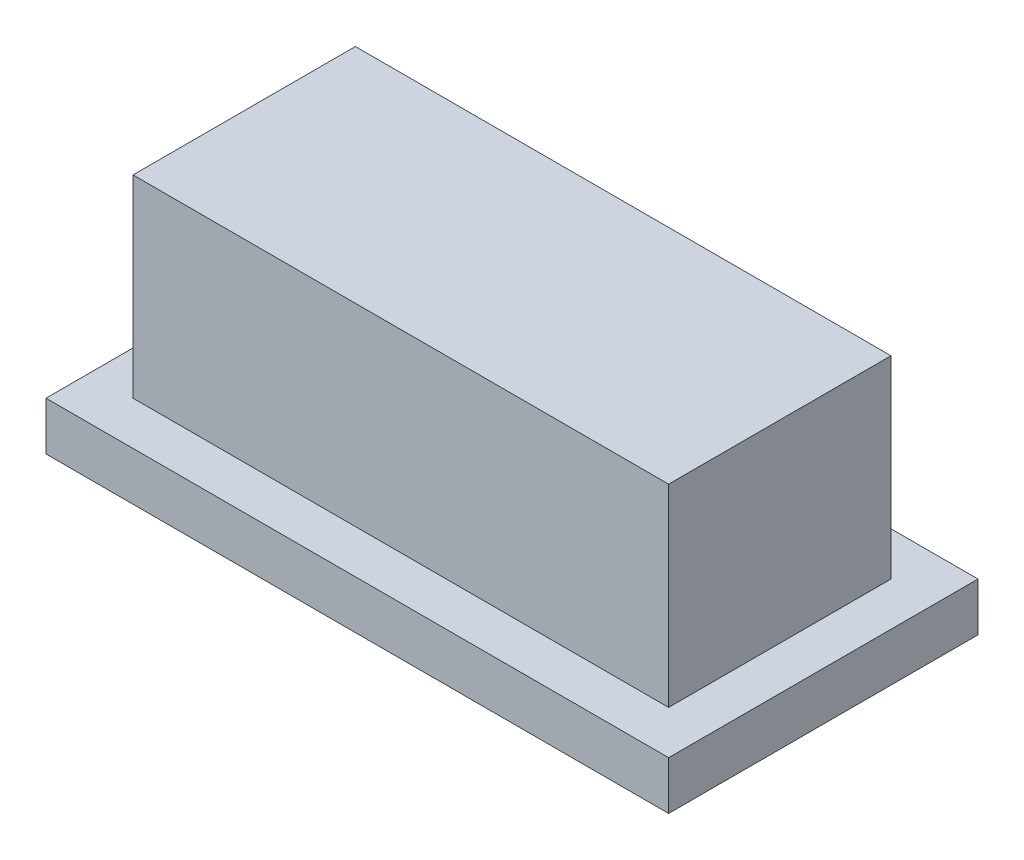
ISO-10303-21;
HEADER;
FILE_DESCRIPTION(('STEP AP214'),'2;1');
FILE_NAME('part.step','',(''),(''),'','','');
FILE_SCHEMA(('AUTOMOTIVE_DESIGN { 1 0 10303 214 1 1 1 1 }'));
ENDSEC;
DATA;
#1=APPLICATION_CONTEXT('core data for automotive mechanical design processes');
#2=APPLICATION_PROTOCOL_DEFINITION('international standard','automotive_design',2000,#1);
#3=PRODUCT_CONTEXT('',#1,'mechanical');
#4=PRODUCT('Part','Part','',(#3));
#5=PRODUCT_RELATED_PRODUCT_CATEGORY('part','',(#4));
#6=PRODUCT_DEFINITION_FORMATION('','',#4);
#7=PRODUCT_DEFINITION_CONTEXT('part definition',#1,'design');
#8=PRODUCT_DEFINITION('design','',#6,#7);
#9=PRODUCT_DEFINITION_SHAPE('','',#8);
#10=(LENGTH_UNIT() NAMED_UNIT(*) SI_UNIT(.MILLI.,.METRE.));
#11=(NAMED_UNIT(*) PLANE_ANGLE_UNIT() SI_UNIT($,.RADIAN.));
#12=(NAMED_UNIT(*) SI_UNIT($,.STERADIAN.) SOLID_ANGLE_UNIT());
#13=UNCERTAINTY_MEASURE_WITH_UNIT(LENGTH_MEASURE(1.E-05),#10,'distance_accuracy_value','');
#14=(GEOMETRIC_REPRESENTATION_CONTEXT(3) GLOBAL_UNCERTAINTY_ASSIGNED_CONTEXT((#13)) GLOBAL_UNIT_ASSIGNED_CONTEXT((#10,
#11,#12)) REPRESENTATION_CONTEXT('',''));
#15=CARTESIAN_POINT('',(0.,0.,0.));
#16=DIRECTION('',(0.,0.,1.));
#17=DIRECTION('',(1.,0.,0.));
#18=AXIS2_PLACEMENT_3D('',#15,#16,#17);
#19=CARTESIAN_POINT('',(0.,1.,0.));
#20=DIRECTION('',(0.,1.,0.));
#21=DIRECTION('',(0.,0.,1.));
#22=AXIS2_PLACEMENT_3D('',#19,#20,#21);
#23=PLANE('',#22);
#24=DIRECTION('',(0.,0.,-1.));
#25=VECTOR('',#24,1.);
#26=CARTESIAN_POINT('',(0.,1.,0.));
#27=LINE('',#26,#25);
#28=CARTESIAN_POINT('',(0.,1.,0.));
#29=VERTEX_POINT('',#28);
#30=CARTESIAN_POINT('',(0.,1.,-6.4));
#31=VERTEX_POINT('',#30);
#32=EDGE_CURVE('E191',#29,#31,#27,.T.);
#33=ORIENTED_EDGE('',*,*,#32,.F.);
#34=DIRECTION('',(1.,0.,0.));
#35=VECTOR('',#34,1.);
#36=CARTESIAN_POINT('',(0.,1.,0.));
#37=LINE('',#36,#35);
#38=CARTESIAN_POINT('',(12.88,1.,0.));
#39=VERTEX_POINT('',#38);
#40=EDGE_CURVE('E194',#29,#39,#37,.T.);
#41=ORIENTED_EDGE('',*,*,#40,.T.);
#42=DIRECTION('',(0.,0.,-1.));
#43=VECTOR('',#42,1.);
#44=CARTESIAN_POINT('',(12.88,1.,0.));
#45=LINE('',#44,#43);
#46=CARTESIAN_POINT('',(12.88,1.,-6.4));
#47=VERTEX_POINT('',#46);
#48=EDGE_CURVE('E197',#39,#47,#45,.T.);
#49=ORIENTED_EDGE('',*,*,#48,.T.);
#50=DIRECTION('',(1.,0.,0.));
#51=VECTOR('',#50,1.);
#52=CARTESIAN_POINT('',(0.,1.,-6.4));
#53=LINE('',#52,#51);
#54=EDGE_CURVE('E199',#31,#47,#53,.T.);
#55=ORIENTED_EDGE('',*,*,#54,.F.);
#56=EDGE_LOOP('',(#33,#41,#49,#55));
#57=FACE_BOUND('',#56,.T.);
#58=DIRECTION('',(0.,0.,1.));
#59=VECTOR('',#58,1.);
#60=CARTESIAN_POINT('',(0.9,1.,-5.5));
#61=LINE('',#60,#59);
#62=CARTESIAN_POINT('',(0.9,1.,-5.5));
#63=VERTEX_POINT('',#62);
#64=CARTESIAN_POINT('',(0.9,1.,-0.9));
#65=VERTEX_POINT('',#64);
#66=EDGE_CURVE('E177',#63,#65,#61,.T.);
#67=ORIENTED_EDGE('',*,*,#66,.F.);
#68=DIRECTION('',(-1.,0.,0.));
#69=VECTOR('',#68,1.);
#70=CARTESIAN_POINT('',(11.98,1.,-5.5));
#71=LINE('',#70,#69);
#72=CARTESIAN_POINT('',(11.98,1.,-5.5));
#73=VERTEX_POINT('',#72);
#74=EDGE_CURVE('E160',#73,#63,#71,.T.);
#75=ORIENTED_EDGE('',*,*,#74,.F.);
#76=DIRECTION('',(0.,0.,-1.));
#77=VECTOR('',#76,1.);
#78=CARTESIAN_POINT('',(11.98,1.,-0.9));
#79=LINE('',#78,#77);
#80=CARTESIAN_POINT('',(11.98,1.,-0.9));
#81=VERTEX_POINT('',#80);
#82=EDGE_CURVE('E168',#81,#73,#79,.T.);
#83=ORIENTED_EDGE('',*,*,#82,.F.);
#84=DIRECTION('',(1.,0.,0.));
#85=VECTOR('',#84,1.);
#86=CARTESIAN_POINT('',(0.9,1.,-0.9));
#87=LINE('',#86,#85);
#88=EDGE_CURVE('E179',#65,#81,#87,.T.);
#89=ORIENTED_EDGE('',*,*,#88,.F.);
#90=EDGE_LOOP('',(#67,#75,#83,#89));
#91=FACE_BOUND('',#90,.T.);
#92=ADVANCED_FACE('F36',(#57,#91),#23,.T.);
#93=CARTESIAN_POINT('',(0.,1.,0.));
#94=DIRECTION('',(-1.,0.,0.));
#95=DIRECTION('',(0.,0.,1.));
#96=AXIS2_PLACEMENT_3D('',#93,#94,#95);
#97=PLANE('',#96);
#98=DIRECTION('',(0.,0.,-1.));
#99=VECTOR('',#98,1.);
#100=CARTESIAN_POINT('',(0.,0.,0.));
#101=LINE('',#100,#99);
#102=CARTESIAN_POINT('',(0.,0.,0.));
#103=VERTEX_POINT('',#102);
#104=CARTESIAN_POINT('',(0.,0.,-6.4));
#105=VERTEX_POINT('',#104);
#106=EDGE_CURVE('E190',#103,#105,#101,.T.);
#107=ORIENTED_EDGE('',*,*,#106,.F.);
#108=DIRECTION('',(0.,-1.,0.));
#109=VECTOR('',#108,1.);
#110=CARTESIAN_POINT('',(0.,1.,0.));
#111=LINE('',#110,#109);
#112=EDGE_CURVE('E11',#29,#103,#111,.T.);
#113=ORIENTED_EDGE('',*,*,#112,.F.);
#114=ORIENTED_EDGE('',*,*,#32,.T.);
#115=DIRECTION('',(0.,-1.,0.));
#116=VECTOR('',#115,1.);
#117=CARTESIAN_POINT('',(0.,1.,-6.4));
#118=LINE('',#117,#116);
#119=EDGE_CURVE('E202',#31,#105,#118,.T.);
#120=ORIENTED_EDGE('',*,*,#119,.T.);
#121=EDGE_LOOP('',(#107,#113,#114,#120));
#122=FACE_BOUND('',#121,.T.);
#123=ADVANCED_FACE('F38',(#122),#97,.T.);
#124=CARTESIAN_POINT('',(0.,1.,0.));
#125=DIRECTION('',(0.,0.,-1.));
#126=DIRECTION('',(-1.,0.,0.));
#127=AXIS2_PLACEMENT_3D('',#124,#125,#126);
#128=PLANE('',#127);
#129=DIRECTION('',(1.,0.,0.));
#130=VECTOR('',#129,1.);
#131=CARTESIAN_POINT('',(0.,0.,0.));
#132=LINE('',#131,#130);
#133=CARTESIAN_POINT('',(12.88,0.,0.));
#134=VERTEX_POINT('',#133);
#135=EDGE_CURVE('E205',#103,#134,#132,.T.);
#136=ORIENTED_EDGE('',*,*,#135,.T.);
#137=DIRECTION('',(0.,-1.,0.));
#138=VECTOR('',#137,1.);
#139=CARTESIAN_POINT('',(12.88,1.,0.));
#140=LINE('',#139,#138);
#141=EDGE_CURVE('E44',#39,#134,#140,.T.);
#142=ORIENTED_EDGE('',*,*,#141,.F.);
#143=ORIENTED_EDGE('',*,*,#40,.F.);
#144=ORIENTED_EDGE('',*,*,#112,.T.);
#145=EDGE_LOOP('',(#136,#142,#143,#144));
#146=FACE_BOUND('',#145,.T.);
#147=ADVANCED_FACE('F234',(#146),#128,.F.);
#148=CARTESIAN_POINT('',(12.88,1.,0.));
#149=DIRECTION('',(-1.,0.,0.));
#150=DIRECTION('',(0.,0.,1.));
#151=AXIS2_PLACEMENT_3D('',#148,#149,#150);
#152=PLANE('',#151);
#153=DIRECTION('',(0.,0.,-1.));
#154=VECTOR('',#153,1.);
#155=CARTESIAN_POINT('',(12.88,0.,0.));
#156=LINE('',#155,#154);
#157=CARTESIAN_POINT('',(12.88,0.,-6.4));
#158=VERTEX_POINT('',#157);
#159=EDGE_CURVE('E207',#134,#158,#156,.T.);
#160=ORIENTED_EDGE('',*,*,#159,.T.);
#161=DIRECTION('',(0.,-1.,0.));
#162=VECTOR('',#161,1.);
#163=CARTESIAN_POINT('',(12.88,1.,-6.4));
#164=LINE('',#163,#162);
#165=EDGE_CURVE('E213',#47,#158,#164,.T.);
#166=ORIENTED_EDGE('',*,*,#165,.F.);
#167=ORIENTED_EDGE('',*,*,#48,.F.);
#168=ORIENTED_EDGE('',*,*,#141,.T.);
#169=EDGE_LOOP('',(#160,#166,#167,#168));
#170=FACE_BOUND('',#169,.T.);
#171=ADVANCED_FACE('F219',(#170),#152,.F.);
#172=CARTESIAN_POINT('',(0.,1.,-6.4));
#173=DIRECTION('',(0.,0.,-1.));
#174=DIRECTION('',(-1.,0.,0.));
#175=AXIS2_PLACEMENT_3D('',#172,#173,#174);
#176=PLANE('',#175);
#177=DIRECTION('',(1.,0.,0.));
#178=VECTOR('',#177,1.);
#179=CARTESIAN_POINT('',(0.,0.,-6.4));
#180=LINE('',#179,#178);
#181=EDGE_CURVE('E195',#105,#158,#180,.T.);
#182=ORIENTED_EDGE('',*,*,#181,.F.);
#183=ORIENTED_EDGE('',*,*,#119,.F.);
#184=ORIENTED_EDGE('',*,*,#54,.T.);
#185=ORIENTED_EDGE('',*,*,#165,.T.);
#186=EDGE_LOOP('',(#182,#183,#184,#185));
#187=FACE_BOUND('',#186,.T.);
#188=ADVANCED_FACE('F229',(#187),#176,.T.);
#189=CARTESIAN_POINT('',(0.,0.,0.));
#190=DIRECTION('',(0.,1.,0.));
#191=DIRECTION('',(0.,0.,1.));
#192=AXIS2_PLACEMENT_3D('',#189,#190,#191);
#193=PLANE('',#192);
#194=DIRECTION('',(1.,0.,0.));
#195=VECTOR('',#194,1.);
#196=CARTESIAN_POINT('',(4.84,0.,-4.3));
#197=LINE('',#196,#195);
#198=CARTESIAN_POINT('',(4.84,0.,-4.3));
#199=VERTEX_POINT('',#198);
#200=CARTESIAN_POINT('',(8.04,0.,-4.3));
#201=VERTEX_POINT('',#200);
#202=EDGE_CURVE('E154',#199,#201,#197,.T.);
#203=ORIENTED_EDGE('',*,*,#202,.F.);
#204=DIRECTION('',(0.,0.,-1.));
#205=VECTOR('',#204,1.);
#206=CARTESIAN_POINT('',(4.84,0.,-2.1));
#207=LINE('',#206,#205);
#208=CARTESIAN_POINT('',(4.84,0.,-2.1));
#209=VERTEX_POINT('',#208);
#210=EDGE_CURVE('E51',#209,#199,#207,.T.);
#211=ORIENTED_EDGE('',*,*,#210,.F.);
#212=DIRECTION('',(-1.,0.,0.));
#213=VECTOR('',#212,1.);
#214=CARTESIAN_POINT('',(4.84,0.,-2.1));
#215=LINE('',#214,#213);
#216=CARTESIAN_POINT('',(8.04,0.,-2.1));
#217=VERTEX_POINT('',#216);
#218=EDGE_CURVE('E145',#217,#209,#215,.T.);
#219=ORIENTED_EDGE('',*,*,#218,.F.);
#220=DIRECTION('',(0.,0.,1.));
#221=VECTOR('',#220,1.);
#222=CARTESIAN_POINT('',(8.04,0.,-2.1));
#223=LINE('',#222,#221);
#224=EDGE_CURVE('E148',#201,#217,#223,.T.);
#225=ORIENTED_EDGE('',*,*,#224,.F.);
#226=EDGE_LOOP('',(#203,#211,#219,#225));
#227=FACE_BOUND('',#226,.T.);
#228=ORIENTED_EDGE('',*,*,#106,.T.);
#229=ORIENTED_EDGE('',*,*,#181,.T.);
#230=ORIENTED_EDGE('',*,*,#159,.F.);
#231=ORIENTED_EDGE('',*,*,#135,.F.);
#232=EDGE_LOOP('',(#228,#229,#230,#231));
#233=FACE_BOUND('',#232,.T.);
#234=ADVANCED_FACE('F225',(#227,#233),#193,.F.);
#235=CARTESIAN_POINT('',(11.98,5.,-5.5));
#236=DIRECTION('',(0.,0.,1.));
#237=DIRECTION('',(1.,0.,0.));
#238=AXIS2_PLACEMENT_3D('',#235,#236,#237);
#239=PLANE('',#238);
#240=ORIENTED_EDGE('',*,*,#74,.T.);
#241=DIRECTION('',(0.,-1.,0.));
#242=VECTOR('',#241,1.);
#243=CARTESIAN_POINT('',(0.9,5.,-5.5));
#244=LINE('',#243,#242);
#245=CARTESIAN_POINT('',(0.9,5.,-5.5));
#246=VERTEX_POINT('',#245);
#247=EDGE_CURVE('E188',#246,#63,#244,.T.);
#248=ORIENTED_EDGE('',*,*,#247,.F.);
#249=DIRECTION('',(-1.,0.,0.));
#250=VECTOR('',#249,1.);
#251=CARTESIAN_POINT('',(11.98,5.,-5.5));
#252=LINE('',#251,#250);
#253=CARTESIAN_POINT('',(11.98,5.,-5.5));
#254=VERTEX_POINT('',#253);
#255=EDGE_CURVE('E164',#254,#246,#252,.T.);
#256=ORIENTED_EDGE('',*,*,#255,.F.);
#257=DIRECTION('',(0.,-1.,0.));
#258=VECTOR('',#257,1.);
#259=CARTESIAN_POINT('',(11.98,5.,-5.5));
#260=LINE('',#259,#258);
#261=EDGE_CURVE('E174',#254,#73,#260,.T.);
#262=ORIENTED_EDGE('',*,*,#261,.T.);
#263=EDGE_LOOP('',(#240,#248,#256,#262));
#264=FACE_BOUND('',#263,.T.);
#265=ADVANCED_FACE('F246',(#264),#239,.F.);
#266=CARTESIAN_POINT('',(0.9,5.,-5.5));
#267=DIRECTION('',(1.,0.,0.));
#268=DIRECTION('',(0.,0.,-1.));
#269=AXIS2_PLACEMENT_3D('',#266,#267,#268);
#270=PLANE('',#269);
#271=ORIENTED_EDGE('',*,*,#66,.T.);
#272=DIRECTION('',(0.,-1.,0.));
#273=VECTOR('',#272,1.);
#274=CARTESIAN_POINT('',(0.9,5.,-0.9));
#275=LINE('',#274,#273);
#276=CARTESIAN_POINT('',(0.9,5.,-0.9));
#277=VERTEX_POINT('',#276);
#278=EDGE_CURVE('E185',#277,#65,#275,.T.);
#279=ORIENTED_EDGE('',*,*,#278,.F.);
#280=DIRECTION('',(0.,0.,1.));
#281=VECTOR('',#280,1.);
#282=CARTESIAN_POINT('',(0.9,5.,-5.5));
#283=LINE('',#282,#281);
#284=EDGE_CURVE('E167',#246,#277,#283,.T.);
#285=ORIENTED_EDGE('',*,*,#284,.F.);
#286=ORIENTED_EDGE('',*,*,#247,.T.);
#287=EDGE_LOOP('',(#271,#279,#285,#286));
#288=FACE_BOUND('',#287,.T.);
#289=ADVANCED_FACE('F274',(#288),#270,.F.);
#290=CARTESIAN_POINT('',(0.9,5.,-0.9));
#291=DIRECTION('',(0.,0.,-1.));
#292=DIRECTION('',(-1.,0.,0.));
#293=AXIS2_PLACEMENT_3D('',#290,#291,#292);
#294=PLANE('',#293);
#295=ORIENTED_EDGE('',*,*,#88,.T.);
#296=DIRECTION('',(0.,-1.,0.));
#297=VECTOR('',#296,1.);
#298=CARTESIAN_POINT('',(11.98,5.,-0.9));
#299=LINE('',#298,#297);
#300=CARTESIAN_POINT('',(11.98,5.,-0.9));
#301=VERTEX_POINT('',#300);
#302=EDGE_CURVE('E59',#301,#81,#299,.T.);
#303=ORIENTED_EDGE('',*,*,#302,.F.);
#304=DIRECTION('',(1.,0.,0.));
#305=VECTOR('',#304,1.);
#306=CARTESIAN_POINT('',(0.9,5.,-0.9));
#307=LINE('',#306,#305);
#308=EDGE_CURVE('E170',#277,#301,#307,.T.);
#309=ORIENTED_EDGE('',*,*,#308,.F.);
#310=ORIENTED_EDGE('',*,*,#278,.T.);
#311=EDGE_LOOP('',(#295,#303,#309,#310));
#312=FACE_BOUND('',#311,.T.);
#313=ADVANCED_FACE('F281',(#312),#294,.F.);
#314=CARTESIAN_POINT('',(11.98,5.,-0.9));
#315=DIRECTION('',(-1.,0.,0.));
#316=DIRECTION('',(0.,0.,1.));
#317=AXIS2_PLACEMENT_3D('',#314,#315,#316);
#318=PLANE('',#317);
#319=ORIENTED_EDGE('',*,*,#82,.T.);
#320=ORIENTED_EDGE('',*,*,#261,.F.);
#321=DIRECTION('',(0.,0.,-1.));
#322=VECTOR('',#321,1.);
#323=CARTESIAN_POINT('',(11.98,5.,-0.9));
#324=LINE('',#323,#322);
#325=EDGE_CURVE('E172',#301,#254,#324,.T.);
#326=ORIENTED_EDGE('',*,*,#325,.F.);
#327=ORIENTED_EDGE('',*,*,#302,.T.);
#328=EDGE_LOOP('',(#319,#320,#326,#327));
#329=FACE_BOUND('',#328,.T.);
#330=ADVANCED_FACE('F288',(#329),#318,.F.);
#331=CARTESIAN_POINT('',(0.,5.,0.));
#332=DIRECTION('',(0.,1.,0.));
#333=DIRECTION('',(0.,0.,1.));
#334=AXIS2_PLACEMENT_3D('',#331,#332,#333);
#335=PLANE('',#334);
#336=ORIENTED_EDGE('',*,*,#255,.T.);
#337=ORIENTED_EDGE('',*,*,#284,.T.);
#338=ORIENTED_EDGE('',*,*,#308,.T.);
#339=ORIENTED_EDGE('',*,*,#325,.T.);
#340=EDGE_LOOP('',(#336,#337,#338,#339));
#341=FACE_BOUND('',#340,.T.);
#342=ADVANCED_FACE('F296',(#341),#335,.T.);
#343=CARTESIAN_POINT('',(4.84,3.1,-2.1));
#344=DIRECTION('',(-1.,0.,0.));
#345=DIRECTION('',(0.,0.,1.));
#346=AXIS2_PLACEMENT_3D('',#343,#344,#345);
#347=PLANE('',#346);
#348=ORIENTED_EDGE('',*,*,#210,.T.);
#349=DIRECTION('',(0.,-1.,0.));
#350=VECTOR('',#349,1.);
#351=CARTESIAN_POINT('',(4.84,3.1,-4.3));
#352=LINE('',#351,#350);
#353=CARTESIAN_POINT('',(4.84,3.1,-4.3));
#354=VERTEX_POINT('',#353);
#355=EDGE_CURVE('E123',#354,#199,#352,.T.);
#356=ORIENTED_EDGE('',*,*,#355,.F.);
#357=DIRECTION('',(0.,0.,-1.));
#358=VECTOR('',#357,1.);
#359=CARTESIAN_POINT('',(4.84,3.1,-2.1));
#360=LINE('',#359,#358);
#361=CARTESIAN_POINT('',(4.84,3.1,-2.1));
#362=VERTEX_POINT('',#361);
#363=EDGE_CURVE('E127',#362,#354,#360,.T.);
#364=ORIENTED_EDGE('',*,*,#363,.F.);
#365=DIRECTION('',(0.,-1.,0.));
#366=VECTOR('',#365,1.);
#367=CARTESIAN_POINT('',(4.84,3.1,-2.1));
#368=LINE('',#367,#366);
#369=EDGE_CURVE('E158',#362,#209,#368,.T.);
#370=ORIENTED_EDGE('',*,*,#369,.T.);
#371=EDGE_LOOP('',(#348,#356,#364,#370));
#372=FACE_BOUND('',#371,.T.);
#373=ADVANCED_FACE('F125',(#372),#347,.F.);
#374=CARTESIAN_POINT('',(4.84,3.1,-2.1));
#375=DIRECTION('',(0.,0.,1.));
#376=DIRECTION('',(1.,0.,0.));
#377=AXIS2_PLACEMENT_3D('',#374,#375,#376);
#378=PLANE('',#377);
#379=ORIENTED_EDGE('',*,*,#218,.T.);
#380=ORIENTED_EDGE('',*,*,#369,.F.);
#381=DIRECTION('',(-1.,0.,0.));
#382=VECTOR('',#381,1.);
#383=CARTESIAN_POINT('',(4.84,3.1,-2.1));
#384=LINE('',#383,#382);
#385=CARTESIAN_POINT('',(8.04,3.1,-2.1));
#386=VERTEX_POINT('',#385);
#387=EDGE_CURVE('E133',#386,#362,#384,.T.);
#388=ORIENTED_EDGE('',*,*,#387,.F.);
#389=DIRECTION('',(0.,-1.,0.));
#390=VECTOR('',#389,1.);
#391=CARTESIAN_POINT('',(8.04,3.1,-2.1));
#392=LINE('',#391,#390);
#393=EDGE_CURVE('E161',#386,#217,#392,.T.);
#394=ORIENTED_EDGE('',*,*,#393,.T.);
#395=EDGE_LOOP('',(#379,#380,#388,#394));
#396=FACE_BOUND('',#395,.T.);
#397=ADVANCED_FACE('F308',(#396),#378,.F.);
#398=CARTESIAN_POINT('',(8.04,3.1,-2.1));
#399=DIRECTION('',(1.,0.,0.));
#400=DIRECTION('',(0.,0.,-1.));
#401=AXIS2_PLACEMENT_3D('',#398,#399,#400);
#402=PLANE('',#401);
#403=ORIENTED_EDGE('',*,*,#224,.T.);
#404=ORIENTED_EDGE('',*,*,#393,.F.);
#405=DIRECTION('',(0.,0.,1.));
#406=VECTOR('',#405,1.);
#407=CARTESIAN_POINT('',(8.04,3.1,-2.1));
#408=LINE('',#407,#406);
#409=CARTESIAN_POINT('',(8.04,3.1,-4.3));
#410=VERTEX_POINT('',#409);
#411=EDGE_CURVE('E141',#410,#386,#408,.T.);
#412=ORIENTED_EDGE('',*,*,#411,.F.);
#413=DIRECTION('',(0.,-1.,0.));
#414=VECTOR('',#413,1.);
#415=CARTESIAN_POINT('',(8.04,3.1,-4.3));
#416=LINE('',#415,#414);
#417=EDGE_CURVE('E132',#410,#201,#416,.T.);
#418=ORIENTED_EDGE('',*,*,#417,.T.);
#419=EDGE_LOOP('',(#403,#404,#412,#418));
#420=FACE_BOUND('',#419,.T.);
#421=ADVANCED_FACE('F315',(#420),#402,.F.);
#422=CARTESIAN_POINT('',(4.84,3.1,-4.3));
#423=DIRECTION('',(0.,0.,-1.));
#424=DIRECTION('',(-1.,0.,0.));
#425=AXIS2_PLACEMENT_3D('',#422,#423,#424);
#426=PLANE('',#425);
#427=ORIENTED_EDGE('',*,*,#202,.T.);
#428=ORIENTED_EDGE('',*,*,#417,.F.);
#429=DIRECTION('',(1.,0.,0.));
#430=VECTOR('',#429,1.);
#431=CARTESIAN_POINT('',(4.84,3.1,-4.3));
#432=LINE('',#431,#430);
#433=EDGE_CURVE('E136',#354,#410,#432,.T.);
#434=ORIENTED_EDGE('',*,*,#433,.F.);
#435=ORIENTED_EDGE('',*,*,#355,.T.);
#436=EDGE_LOOP('',(#427,#428,#434,#435));
#437=FACE_BOUND('',#436,.T.);
#438=ADVANCED_FACE('F137',(#437),#426,.F.);
#439=CARTESIAN_POINT('',(0.,3.1,0.));
#440=DIRECTION('',(0.,-1.,0.));
#441=DIRECTION('',(0.,0.,-1.));
#442=AXIS2_PLACEMENT_3D('',#439,#440,#441);
#443=PLANE('',#442);
#444=ORIENTED_EDGE('',*,*,#363,.T.);
#445=ORIENTED_EDGE('',*,*,#433,.T.);
#446=ORIENTED_EDGE('',*,*,#411,.T.);
#447=ORIENTED_EDGE('',*,*,#387,.T.);
#448=EDGE_LOOP('',(#444,#445,#446,#447));
#449=FACE_BOUND('',#448,.T.);
#450=ADVANCED_FACE('F143',(#449),#443,.T.);
#451=CLOSED_SHELL('',(#92,#123,#147,#171,#188,#234,#265,#289,#313,#330,#342,#373,#397,#421,#438,#450));
#452=MANIFOLD_SOLID_BREP('B2',#451);
#453=ADVANCED_BREP_SHAPE_REPRESENTATION('',(#18,#452),#14);
#454=SHAPE_DEFINITION_REPRESENTATION(#9,#453);
ENDSEC;
END-ISO-10303-21;
